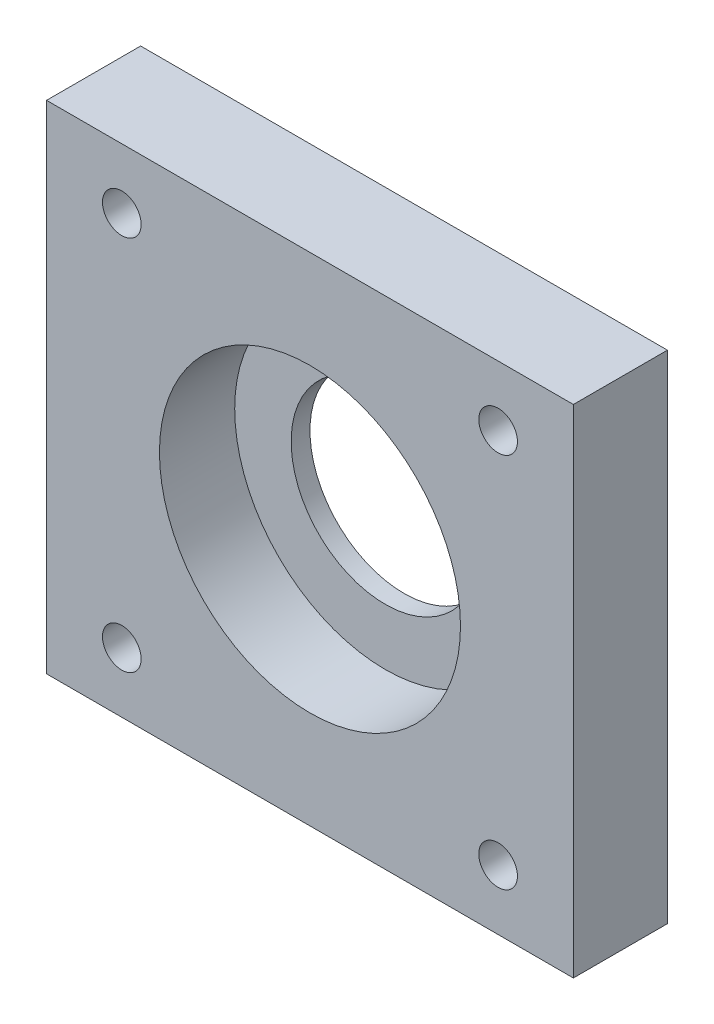
ISO-10303-21;
HEADER;
FILE_DESCRIPTION(('STEP AP214'),'2;1');
FILE_NAME('part.step','',(''),(''),'','','');
FILE_SCHEMA(('AUTOMOTIVE_DESIGN { 1 0 10303 214 1 1 1 1 }'));
ENDSEC;
DATA;
#1=APPLICATION_CONTEXT('core data for automotive mechanical design processes');
#2=APPLICATION_PROTOCOL_DEFINITION('international standard','automotive_design',2000,#1);
#3=PRODUCT_CONTEXT('',#1,'mechanical');
#4=PRODUCT('Part','Part','',(#3));
#5=PRODUCT_RELATED_PRODUCT_CATEGORY('part','',(#4));
#6=PRODUCT_DEFINITION_FORMATION('','',#4);
#7=PRODUCT_DEFINITION_CONTEXT('part definition',#1,'design');
#8=PRODUCT_DEFINITION('design','',#6,#7);
#9=PRODUCT_DEFINITION_SHAPE('','',#8);
#10=(LENGTH_UNIT() NAMED_UNIT(*) SI_UNIT(.MILLI.,.METRE.));
#11=(NAMED_UNIT(*) PLANE_ANGLE_UNIT() SI_UNIT($,.RADIAN.));
#12=(NAMED_UNIT(*) SI_UNIT($,.STERADIAN.) SOLID_ANGLE_UNIT());
#13=UNCERTAINTY_MEASURE_WITH_UNIT(LENGTH_MEASURE(1.E-05),#10,'distance_accuracy_value','');
#14=(GEOMETRIC_REPRESENTATION_CONTEXT(3) GLOBAL_UNCERTAINTY_ASSIGNED_CONTEXT((#13)) GLOBAL_UNIT_ASSIGNED_CONTEXT((#10,
#11,#12)) REPRESENTATION_CONTEXT('',''));
#15=CARTESIAN_POINT('',(0.,0.,0.));
#16=DIRECTION('',(0.,0.,1.));
#17=DIRECTION('',(1.,0.,0.));
#18=AXIS2_PLACEMENT_3D('',#15,#16,#17);
#19=CARTESIAN_POINT('',(0.,0.,0.));
#20=DIRECTION('',(0.,0.,1.));
#21=DIRECTION('',(1.,0.,0.));
#22=AXIS2_PLACEMENT_3D('',#19,#20,#21);
#23=CYLINDRICAL_SURFACE('',#22,15.875);
#24=CARTESIAN_POINT('',(0.,0.,0.));
#25=DIRECTION('',(0.,0.,1.));
#26=DIRECTION('',(1.,0.,0.));
#27=AXIS2_PLACEMENT_3D('',#24,#25,#26);
#28=CIRCLE('',#27,15.875);
#29=CARTESIAN_POINT('',(15.875,0.,0.));
#30=VERTEX_POINT('',#29);
#31=EDGE_CURVE('E136',#30,#30,#28,.T.);
#32=ORIENTED_EDGE('',*,*,#31,.F.);
#33=EDGE_LOOP('',(#32));
#34=FACE_BOUND('',#33,.T.);
#35=CARTESIAN_POINT('',(0.,0.,3.175));
#36=DIRECTION('',(0.,0.,1.));
#37=DIRECTION('',(1.,0.,0.));
#38=AXIS2_PLACEMENT_3D('',#35,#36,#37);
#39=CIRCLE('',#38,15.875);
#40=CARTESIAN_POINT('',(15.875,0.,3.175));
#41=VERTEX_POINT('',#40);
#42=EDGE_CURVE('E39',#41,#41,#39,.F.);
#43=ORIENTED_EDGE('',*,*,#42,.F.);
#44=EDGE_LOOP('',(#43));
#45=FACE_BOUND('',#44,.T.);
#46=ADVANCED_FACE('F35',(#34,#45),#23,.F.);
#47=CARTESIAN_POINT('',(44.45,41.91,15.875));
#48=DIRECTION('',(-1.,0.,0.));
#49=DIRECTION('',(0.,-1.,0.));
#50=AXIS2_PLACEMENT_3D('',#47,#48,#49);
#51=PLANE('',#50);
#52=DIRECTION('',(0.,1.,0.));
#53=VECTOR('',#52,1.);
#54=CARTESIAN_POINT('',(44.45,41.91,0.));
#55=LINE('',#54,#53);
#56=CARTESIAN_POINT('',(44.45,-41.91,0.));
#57=VERTEX_POINT('',#56);
#58=CARTESIAN_POINT('',(44.45,41.91,0.));
#59=VERTEX_POINT('',#58);
#60=EDGE_CURVE('E101',#57,#59,#55,.T.);
#61=ORIENTED_EDGE('',*,*,#60,.T.);
#62=DIRECTION('',(0.,0.,-1.));
#63=VECTOR('',#62,1.);
#64=CARTESIAN_POINT('',(44.45,41.91,15.875));
#65=LINE('',#64,#63);
#66=CARTESIAN_POINT('',(44.45,41.91,15.875));
#67=VERTEX_POINT('',#66);
#68=EDGE_CURVE('E11',#67,#59,#65,.T.);
#69=ORIENTED_EDGE('',*,*,#68,.F.);
#70=DIRECTION('',(0.,1.,0.));
#71=VECTOR('',#70,1.);
#72=CARTESIAN_POINT('',(44.45,41.91,15.875));
#73=LINE('',#72,#71);
#74=CARTESIAN_POINT('',(44.45,-41.91,15.875));
#75=VERTEX_POINT('',#74);
#76=EDGE_CURVE('E88',#75,#67,#73,.T.);
#77=ORIENTED_EDGE('',*,*,#76,.F.);
#78=DIRECTION('',(0.,0.,-1.));
#79=VECTOR('',#78,1.);
#80=CARTESIAN_POINT('',(44.45,-41.91,15.875));
#81=LINE('',#80,#79);
#82=EDGE_CURVE('E97',#75,#57,#81,.T.);
#83=ORIENTED_EDGE('',*,*,#82,.T.);
#84=EDGE_LOOP('',(#61,#69,#77,#83));
#85=FACE_BOUND('',#84,.T.);
#86=ADVANCED_FACE('F37',(#85),#51,.F.);
#87=CARTESIAN_POINT('',(-44.45,41.91,15.875));
#88=DIRECTION('',(0.,-1.,0.));
#89=DIRECTION('',(0.,0.,-1.));
#90=AXIS2_PLACEMENT_3D('',#87,#88,#89);
#91=PLANE('',#90);
#92=DIRECTION('',(-1.,0.,0.));
#93=VECTOR('',#92,1.);
#94=CARTESIAN_POINT('',(-44.45,41.91,0.));
#95=LINE('',#94,#93);
#96=CARTESIAN_POINT('',(-44.45,41.91,0.));
#97=VERTEX_POINT('',#96);
#98=EDGE_CURVE('E92',#59,#97,#95,.T.);
#99=ORIENTED_EDGE('',*,*,#98,.T.);
#100=DIRECTION('',(0.,0.,-1.));
#101=VECTOR('',#100,1.);
#102=CARTESIAN_POINT('',(-44.45,41.91,15.875));
#103=LINE('',#102,#101);
#104=CARTESIAN_POINT('',(-44.45,41.91,15.875));
#105=VERTEX_POINT('',#104);
#106=EDGE_CURVE('E45',#105,#97,#103,.T.);
#107=ORIENTED_EDGE('',*,*,#106,.F.);
#108=DIRECTION('',(-1.,0.,0.));
#109=VECTOR('',#108,1.);
#110=CARTESIAN_POINT('',(-44.45,41.91,15.875));
#111=LINE('',#110,#109);
#112=EDGE_CURVE('E83',#67,#105,#111,.T.);
#113=ORIENTED_EDGE('',*,*,#112,.F.);
#114=ORIENTED_EDGE('',*,*,#68,.T.);
#115=EDGE_LOOP('',(#99,#107,#113,#114));
#116=FACE_BOUND('',#115,.T.);
#117=ADVANCED_FACE('F91',(#116),#91,.F.);
#118=CARTESIAN_POINT('',(-44.45,41.91,15.875));
#119=DIRECTION('',(1.,0.,0.));
#120=DIRECTION('',(0.,0.,-1.));
#121=AXIS2_PLACEMENT_3D('',#118,#119,#120);
#122=PLANE('',#121);
#123=DIRECTION('',(0.,-1.,0.));
#124=VECTOR('',#123,1.);
#125=CARTESIAN_POINT('',(-44.45,41.91,0.));
#126=LINE('',#125,#124);
#127=CARTESIAN_POINT('',(-44.45,-41.91,0.));
#128=VERTEX_POINT('',#127);
#129=EDGE_CURVE('E70',#97,#128,#126,.T.);
#130=ORIENTED_EDGE('',*,*,#129,.T.);
#131=DIRECTION('',(0.,0.,-1.));
#132=VECTOR('',#131,1.);
#133=CARTESIAN_POINT('',(-44.45,-41.91,15.875));
#134=LINE('',#133,#132);
#135=CARTESIAN_POINT('',(-44.45,-41.91,15.875));
#136=VERTEX_POINT('',#135);
#137=EDGE_CURVE('E93',#136,#128,#134,.T.);
#138=ORIENTED_EDGE('',*,*,#137,.F.);
#139=DIRECTION('',(0.,-1.,0.));
#140=VECTOR('',#139,1.);
#141=CARTESIAN_POINT('',(-44.45,41.91,15.875));
#142=LINE('',#141,#140);
#143=EDGE_CURVE('E86',#105,#136,#142,.T.);
#144=ORIENTED_EDGE('',*,*,#143,.F.);
#145=ORIENTED_EDGE('',*,*,#106,.T.);
#146=EDGE_LOOP('',(#130,#138,#144,#145));
#147=FACE_BOUND('',#146,.T.);
#148=ADVANCED_FACE('F95',(#147),#122,.F.);
#149=CARTESIAN_POINT('',(-44.45,-41.91,15.875));
#150=DIRECTION('',(0.,1.,0.));
#151=DIRECTION('',(0.,0.,1.));
#152=AXIS2_PLACEMENT_3D('',#149,#150,#151);
#153=PLANE('',#152);
#154=DIRECTION('',(1.,0.,0.));
#155=VECTOR('',#154,1.);
#156=CARTESIAN_POINT('',(-44.45,-41.91,0.));
#157=LINE('',#156,#155);
#158=EDGE_CURVE('E76',#128,#57,#157,.T.);
#159=ORIENTED_EDGE('',*,*,#158,.T.);
#160=ORIENTED_EDGE('',*,*,#82,.F.);
#161=DIRECTION('',(1.,0.,0.));
#162=VECTOR('',#161,1.);
#163=CARTESIAN_POINT('',(-44.45,-41.91,15.875));
#164=LINE('',#163,#162);
#165=EDGE_CURVE('E53',#136,#75,#164,.T.);
#166=ORIENTED_EDGE('',*,*,#165,.F.);
#167=ORIENTED_EDGE('',*,*,#137,.T.);
#168=EDGE_LOOP('',(#159,#160,#166,#167));
#169=FACE_BOUND('',#168,.T.);
#170=ADVANCED_FACE('F109',(#169),#153,.F.);
#171=CARTESIAN_POINT('',(0.,0.,15.875));
#172=DIRECTION('',(0.,0.,1.));
#173=DIRECTION('',(1.,0.,0.));
#174=AXIS2_PLACEMENT_3D('',#171,#172,#173);
#175=PLANE('',#174);
#176=CARTESIAN_POINT('',(0.,0.,15.875));
#177=DIRECTION('',(0.,0.,1.));
#178=DIRECTION('',(1.,0.,0.));
#179=AXIS2_PLACEMENT_3D('',#176,#177,#178);
#180=CIRCLE('',#179,25.4);
#181=CARTESIAN_POINT('',(25.4,0.,15.875));
#182=VERTEX_POINT('',#181);
#183=EDGE_CURVE('E141',#182,#182,#180,.T.);
#184=ORIENTED_EDGE('',*,*,#183,.F.);
#185=EDGE_LOOP('',(#184));
#186=FACE_BOUND('',#185,.T.);
#187=CARTESIAN_POINT('',(-31.75,-31.75,15.875));
#188=DIRECTION('',(0.,0.,1.));
#189=DIRECTION('',(1.,0.,0.));
#190=AXIS2_PLACEMENT_3D('',#187,#188,#189);
#191=CIRCLE('',#190,3.2639);
#192=CARTESIAN_POINT('',(-28.4861,-31.75,15.875));
#193=VERTEX_POINT('',#192);
#194=EDGE_CURVE('E133',#193,#193,#191,.T.);
#195=ORIENTED_EDGE('',*,*,#194,.F.);
#196=EDGE_LOOP('',(#195));
#197=FACE_BOUND('',#196,.T.);
#198=CARTESIAN_POINT('',(31.75,-31.75,15.875));
#199=DIRECTION('',(0.,0.,1.));
#200=DIRECTION('',(1.,0.,0.));
#201=AXIS2_PLACEMENT_3D('',#198,#199,#200);
#202=CIRCLE('',#201,3.2639);
#203=CARTESIAN_POINT('',(35.0139,-31.75,15.875));
#204=VERTEX_POINT('',#203);
#205=EDGE_CURVE('E127',#204,#204,#202,.T.);
#206=ORIENTED_EDGE('',*,*,#205,.F.);
#207=EDGE_LOOP('',(#206));
#208=FACE_BOUND('',#207,.T.);
#209=CARTESIAN_POINT('',(31.75,31.75,15.875));
#210=DIRECTION('',(0.,0.,1.));
#211=DIRECTION('',(1.,0.,0.));
#212=AXIS2_PLACEMENT_3D('',#209,#210,#211);
#213=CIRCLE('',#212,3.2639);
#214=CARTESIAN_POINT('',(35.0139,31.75,15.875));
#215=VERTEX_POINT('',#214);
#216=EDGE_CURVE('E121',#215,#215,#213,.T.);
#217=ORIENTED_EDGE('',*,*,#216,.F.);
#218=EDGE_LOOP('',(#217));
#219=FACE_BOUND('',#218,.T.);
#220=CARTESIAN_POINT('',(-31.75,31.75,15.875));
#221=DIRECTION('',(0.,0.,1.));
#222=DIRECTION('',(1.,0.,0.));
#223=AXIS2_PLACEMENT_3D('',#220,#221,#222);
#224=CIRCLE('',#223,3.2639);
#225=CARTESIAN_POINT('',(-28.4861,31.75,15.875));
#226=VERTEX_POINT('',#225);
#227=EDGE_CURVE('E115',#226,#226,#224,.T.);
#228=ORIENTED_EDGE('',*,*,#227,.F.);
#229=EDGE_LOOP('',(#228));
#230=FACE_BOUND('',#229,.T.);
#231=ORIENTED_EDGE('',*,*,#76,.T.);
#232=ORIENTED_EDGE('',*,*,#112,.T.);
#233=ORIENTED_EDGE('',*,*,#143,.T.);
#234=ORIENTED_EDGE('',*,*,#165,.T.);
#235=EDGE_LOOP('',(#231,#232,#233,#234));
#236=FACE_BOUND('',#235,.T.);
#237=ADVANCED_FACE('F84',(#186,#197,#208,#219,#230,#236),#175,.T.);
#238=CARTESIAN_POINT('',(0.,0.,0.));
#239=DIRECTION('',(0.,0.,1.));
#240=DIRECTION('',(1.,0.,0.));
#241=AXIS2_PLACEMENT_3D('',#238,#239,#240);
#242=PLANE('',#241);
#243=ORIENTED_EDGE('',*,*,#31,.T.);
#244=EDGE_LOOP('',(#243));
#245=FACE_BOUND('',#244,.T.);
#246=CARTESIAN_POINT('',(-31.75,-31.75,0.));
#247=DIRECTION('',(0.,0.,1.));
#248=DIRECTION('',(1.,0.,0.));
#249=AXIS2_PLACEMENT_3D('',#246,#247,#248);
#250=CIRCLE('',#249,3.2639);
#251=CARTESIAN_POINT('',(-28.4861,-31.75,0.));
#252=VERTEX_POINT('',#251);
#253=EDGE_CURVE('E130',#252,#252,#250,.T.);
#254=ORIENTED_EDGE('',*,*,#253,.T.);
#255=EDGE_LOOP('',(#254));
#256=FACE_BOUND('',#255,.T.);
#257=CARTESIAN_POINT('',(31.75,-31.75,0.));
#258=DIRECTION('',(0.,0.,1.));
#259=DIRECTION('',(1.,0.,0.));
#260=AXIS2_PLACEMENT_3D('',#257,#258,#259);
#261=CIRCLE('',#260,3.2639);
#262=CARTESIAN_POINT('',(35.0139,-31.75,0.));
#263=VERTEX_POINT('',#262);
#264=EDGE_CURVE('E124',#263,#263,#261,.T.);
#265=ORIENTED_EDGE('',*,*,#264,.T.);
#266=EDGE_LOOP('',(#265));
#267=FACE_BOUND('',#266,.T.);
#268=CARTESIAN_POINT('',(31.75,31.75,0.));
#269=DIRECTION('',(0.,0.,1.));
#270=DIRECTION('',(1.,0.,0.));
#271=AXIS2_PLACEMENT_3D('',#268,#269,#270);
#272=CIRCLE('',#271,3.2639);
#273=CARTESIAN_POINT('',(35.0139,31.75,0.));
#274=VERTEX_POINT('',#273);
#275=EDGE_CURVE('E118',#274,#274,#272,.T.);
#276=ORIENTED_EDGE('',*,*,#275,.T.);
#277=EDGE_LOOP('',(#276));
#278=FACE_BOUND('',#277,.T.);
#279=CARTESIAN_POINT('',(-31.75,31.75,0.));
#280=DIRECTION('',(0.,0.,1.));
#281=DIRECTION('',(1.,0.,0.));
#282=AXIS2_PLACEMENT_3D('',#279,#280,#281);
#283=CIRCLE('',#282,3.2639);
#284=CARTESIAN_POINT('',(-28.4861,31.75,0.));
#285=VERTEX_POINT('',#284);
#286=EDGE_CURVE('E104',#285,#285,#283,.T.);
#287=ORIENTED_EDGE('',*,*,#286,.T.);
#288=EDGE_LOOP('',(#287));
#289=FACE_BOUND('',#288,.T.);
#290=ORIENTED_EDGE('',*,*,#60,.F.);
#291=ORIENTED_EDGE('',*,*,#158,.F.);
#292=ORIENTED_EDGE('',*,*,#129,.F.);
#293=ORIENTED_EDGE('',*,*,#98,.F.);
#294=EDGE_LOOP('',(#290,#291,#292,#293));
#295=FACE_BOUND('',#294,.T.);
#296=ADVANCED_FACE('F112',(#245,#256,#267,#278,#289,#295),#242,.F.);
#297=CARTESIAN_POINT('',(-31.75,31.75,0.));
#298=DIRECTION('',(0.,0.,1.));
#299=DIRECTION('',(1.,0.,0.));
#300=AXIS2_PLACEMENT_3D('',#297,#298,#299);
#301=CYLINDRICAL_SURFACE('',#300,3.2639);
#302=ORIENTED_EDGE('',*,*,#286,.F.);
#303=EDGE_LOOP('',(#302));
#304=FACE_BOUND('',#303,.T.);
#305=ORIENTED_EDGE('',*,*,#227,.T.);
#306=EDGE_LOOP('',(#305));
#307=FACE_BOUND('',#306,.T.);
#308=ADVANCED_FACE('F175',(#304,#307),#301,.F.);
#309=CARTESIAN_POINT('',(31.75,31.75,0.));
#310=DIRECTION('',(0.,0.,1.));
#311=DIRECTION('',(1.,0.,0.));
#312=AXIS2_PLACEMENT_3D('',#309,#310,#311);
#313=CYLINDRICAL_SURFACE('',#312,3.2639);
#314=ORIENTED_EDGE('',*,*,#275,.F.);
#315=EDGE_LOOP('',(#314));
#316=FACE_BOUND('',#315,.T.);
#317=ORIENTED_EDGE('',*,*,#216,.T.);
#318=EDGE_LOOP('',(#317));
#319=FACE_BOUND('',#318,.T.);
#320=ADVANCED_FACE('F171',(#316,#319),#313,.F.);
#321=CARTESIAN_POINT('',(31.75,-31.75,0.));
#322=DIRECTION('',(0.,0.,1.));
#323=DIRECTION('',(1.,0.,0.));
#324=AXIS2_PLACEMENT_3D('',#321,#322,#323);
#325=CYLINDRICAL_SURFACE('',#324,3.2639);
#326=ORIENTED_EDGE('',*,*,#264,.F.);
#327=EDGE_LOOP('',(#326));
#328=FACE_BOUND('',#327,.T.);
#329=ORIENTED_EDGE('',*,*,#205,.T.);
#330=EDGE_LOOP('',(#329));
#331=FACE_BOUND('',#330,.T.);
#332=ADVANCED_FACE('F167',(#328,#331),#325,.F.);
#333=CARTESIAN_POINT('',(-31.75,-31.75,0.));
#334=DIRECTION('',(0.,0.,1.));
#335=DIRECTION('',(1.,0.,0.));
#336=AXIS2_PLACEMENT_3D('',#333,#334,#335);
#337=CYLINDRICAL_SURFACE('',#336,3.2639);
#338=ORIENTED_EDGE('',*,*,#253,.F.);
#339=EDGE_LOOP('',(#338));
#340=FACE_BOUND('',#339,.T.);
#341=ORIENTED_EDGE('',*,*,#194,.T.);
#342=EDGE_LOOP('',(#341));
#343=FACE_BOUND('',#342,.T.);
#344=ADVANCED_FACE('F164',(#340,#343),#337,.F.);
#345=CARTESIAN_POINT('',(0.,0.,3.175));
#346=DIRECTION('',(0.,0.,1.));
#347=DIRECTION('',(1.,0.,0.));
#348=AXIS2_PLACEMENT_3D('',#345,#346,#347);
#349=PLANE('',#348);
#350=CARTESIAN_POINT('',(0.,0.,3.175));
#351=DIRECTION('',(0.,0.,1.));
#352=DIRECTION('',(1.,0.,0.));
#353=AXIS2_PLACEMENT_3D('',#350,#351,#352);
#354=CIRCLE('',#353,25.4);
#355=CARTESIAN_POINT('',(25.4,0.,3.175));
#356=VERTEX_POINT('',#355);
#357=EDGE_CURVE('E144',#356,#356,#354,.T.);
#358=ORIENTED_EDGE('',*,*,#357,.T.);
#359=EDGE_LOOP('',(#358));
#360=FACE_BOUND('',#359,.T.);
#361=ORIENTED_EDGE('',*,*,#42,.T.);
#362=EDGE_LOOP('',(#361));
#363=FACE_BOUND('',#362,.T.);
#364=ADVANCED_FACE('F151',(#360,#363),#349,.T.);
#365=CARTESIAN_POINT('',(0.,0.,3.175));
#366=DIRECTION('',(0.,0.,1.));
#367=DIRECTION('',(1.,0.,0.));
#368=AXIS2_PLACEMENT_3D('',#365,#366,#367);
#369=CYLINDRICAL_SURFACE('',#368,25.4);
#370=ORIENTED_EDGE('',*,*,#357,.F.);
#371=EDGE_LOOP('',(#370));
#372=FACE_BOUND('',#371,.T.);
#373=ORIENTED_EDGE('',*,*,#183,.T.);
#374=EDGE_LOOP('',(#373));
#375=FACE_BOUND('',#374,.T.);
#376=ADVANCED_FACE('F162',(#372,#375),#369,.F.);
#377=CLOSED_SHELL('',(#46,#86,#117,#148,#170,#237,#296,#308,#320,#332,#344,#364,#376));
#378=MANIFOLD_SOLID_BREP('B2',#377);
#379=ADVANCED_BREP_SHAPE_REPRESENTATION('',(#18,#378),#14);
#380=SHAPE_DEFINITION_REPRESENTATION(#9,#379);
ENDSEC;
END-ISO-10303-21;
